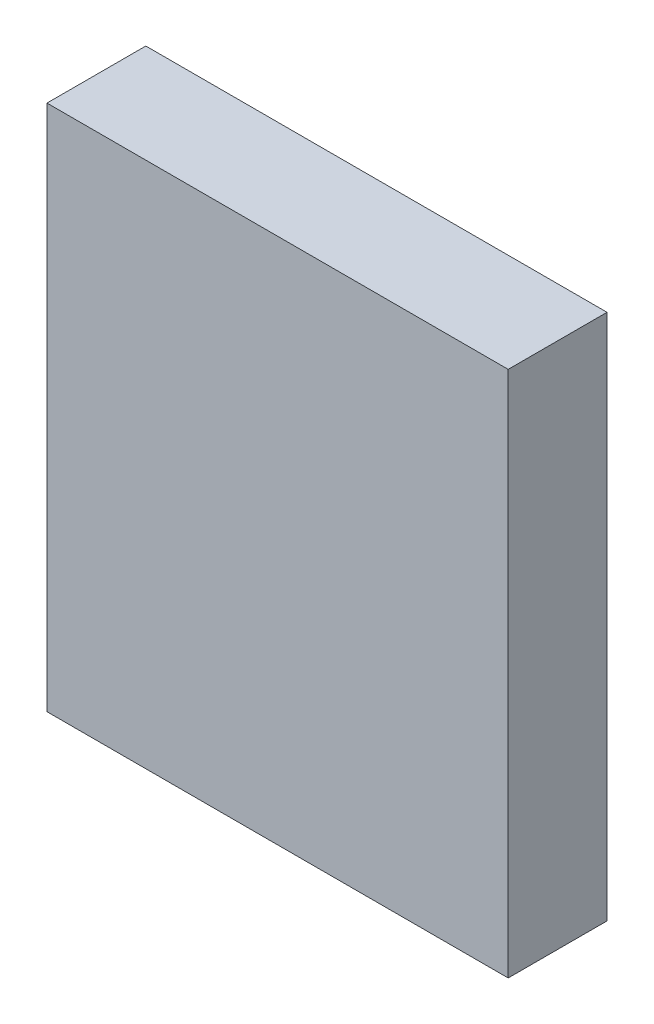
ISO-10303-21;
HEADER;
FILE_DESCRIPTION(('STEP AP214'),'2;1');
FILE_NAME('part.step','',(''),(''),'','','');
FILE_SCHEMA(('AUTOMOTIVE_DESIGN { 1 0 10303 214 1 1 1 1 }'));
ENDSEC;
DATA;
#1=APPLICATION_CONTEXT('core data for automotive mechanical design processes');
#2=APPLICATION_PROTOCOL_DEFINITION('international standard','automotive_design',2000,#1);
#3=PRODUCT_CONTEXT('',#1,'mechanical');
#4=PRODUCT('Part','Part','',(#3));
#5=PRODUCT_RELATED_PRODUCT_CATEGORY('part','',(#4));
#6=PRODUCT_DEFINITION_FORMATION('','',#4);
#7=PRODUCT_DEFINITION_CONTEXT('part definition',#1,'design');
#8=PRODUCT_DEFINITION('design','',#6,#7);
#9=PRODUCT_DEFINITION_SHAPE('','',#8);
#10=(LENGTH_UNIT() NAMED_UNIT(*) SI_UNIT(.MILLI.,.METRE.));
#11=(NAMED_UNIT(*) PLANE_ANGLE_UNIT() SI_UNIT($,.RADIAN.));
#12=(NAMED_UNIT(*) SI_UNIT($,.STERADIAN.) SOLID_ANGLE_UNIT());
#13=UNCERTAINTY_MEASURE_WITH_UNIT(LENGTH_MEASURE(1.E-05),#10,'distance_accuracy_value','');
#14=(GEOMETRIC_REPRESENTATION_CONTEXT(3) GLOBAL_UNCERTAINTY_ASSIGNED_CONTEXT((#13)) GLOBAL_UNIT_ASSIGNED_CONTEXT((#10,
#11,#12)) REPRESENTATION_CONTEXT('',''));
#15=CARTESIAN_POINT('',(0.,0.,0.));
#16=DIRECTION('',(0.,0.,1.));
#17=DIRECTION('',(1.,0.,0.));
#18=AXIS2_PLACEMENT_3D('',#15,#16,#17);
#19=CARTESIAN_POINT('',(0.,29.27740290761,76.2));
#20=DIRECTION('',(-1.,0.,0.));
#21=DIRECTION('',(0.,0.,1.));
#22=AXIS2_PLACEMENT_3D('',#19,#20,#21);
#23=PLANE('',#22);
#24=DIRECTION('',(0.,1.,0.));
#25=VECTOR('',#24,1.);
#26=CARTESIAN_POINT('',(0.,29.27740290761,0.));
#27=LINE('',#26,#25);
#28=CARTESIAN_POINT('',(0.,0.,0.));
#29=VERTEX_POINT('',#28);
#30=CARTESIAN_POINT('',(0.,406.4,0.));
#31=VERTEX_POINT('',#30);
#32=EDGE_CURVE('E101',#29,#31,#27,.T.);
#33=ORIENTED_EDGE('',*,*,#32,.F.);
#34=DIRECTION('',(0.,0.,-1.));
#35=VECTOR('',#34,1.);
#36=CARTESIAN_POINT('',(0.,0.,76.2));
#37=LINE('',#36,#35);
#38=CARTESIAN_POINT('',(0.,0.,76.2));
#39=VERTEX_POINT('',#38);
#40=EDGE_CURVE('E11',#39,#29,#37,.T.);
#41=ORIENTED_EDGE('',*,*,#40,.F.);
#42=DIRECTION('',(0.,1.,0.));
#43=VECTOR('',#42,1.);
#44=CARTESIAN_POINT('',(0.,29.27740290761,76.2));
#45=LINE('',#44,#43);
#46=CARTESIAN_POINT('',(0.,406.4,76.2));
#47=VERTEX_POINT('',#46);
#48=EDGE_CURVE('E79',#39,#47,#45,.T.);
#49=ORIENTED_EDGE('',*,*,#48,.T.);
#50=DIRECTION('',(0.,0.,-1.));
#51=VECTOR('',#50,1.);
#52=CARTESIAN_POINT('',(0.,406.4,76.2));
#53=LINE('',#52,#51);
#54=EDGE_CURVE('E38',#47,#31,#53,.T.);
#55=ORIENTED_EDGE('',*,*,#54,.T.);
#56=EDGE_LOOP('',(#33,#41,#49,#55));
#57=FACE_BOUND('',#56,.T.);
#58=ADVANCED_FACE('F16',(#57),#23,.T.);
#59=CARTESIAN_POINT('',(33.0767557024956,0.,76.2));
#60=DIRECTION('',(0.,1.,0.));
#61=DIRECTION('',(0.,0.,1.));
#62=AXIS2_PLACEMENT_3D('',#59,#60,#61);
#63=PLANE('',#62);
#64=DIRECTION('',(1.,0.,0.));
#65=VECTOR('',#64,1.);
#66=CARTESIAN_POINT('',(33.0767557024956,0.,0.));
#67=LINE('',#66,#65);
#68=CARTESIAN_POINT('',(355.6,0.,0.));
#69=VERTEX_POINT('',#68);
#70=EDGE_CURVE('E86',#29,#69,#67,.T.);
#71=ORIENTED_EDGE('',*,*,#70,.T.);
#72=DIRECTION('',(0.,0.,-1.));
#73=VECTOR('',#72,1.);
#74=CARTESIAN_POINT('',(355.6,0.,76.2));
#75=LINE('',#74,#73);
#76=CARTESIAN_POINT('',(355.6,0.,76.2));
#77=VERTEX_POINT('',#76);
#78=EDGE_CURVE('E25',#77,#69,#75,.T.);
#79=ORIENTED_EDGE('',*,*,#78,.F.);
#80=DIRECTION('',(1.,0.,0.));
#81=VECTOR('',#80,1.);
#82=CARTESIAN_POINT('',(33.0767557024956,0.,76.2));
#83=LINE('',#82,#81);
#84=EDGE_CURVE('E73',#39,#77,#83,.T.);
#85=ORIENTED_EDGE('',*,*,#84,.F.);
#86=ORIENTED_EDGE('',*,*,#40,.T.);
#87=EDGE_LOOP('',(#71,#79,#85,#86));
#88=FACE_BOUND('',#87,.T.);
#89=ADVANCED_FACE('F84',(#88),#63,.F.);
#90=CARTESIAN_POINT('',(355.6,29.27740290761,76.2));
#91=DIRECTION('',(-1.,0.,0.));
#92=DIRECTION('',(0.,-1.,0.));
#93=AXIS2_PLACEMENT_3D('',#90,#91,#92);
#94=PLANE('',#93);
#95=DIRECTION('',(0.,1.,0.));
#96=VECTOR('',#95,1.);
#97=CARTESIAN_POINT('',(355.6,29.27740290761,0.));
#98=LINE('',#97,#96);
#99=CARTESIAN_POINT('',(355.6,406.4,0.));
#100=VERTEX_POINT('',#99);
#101=EDGE_CURVE('E106',#69,#100,#98,.T.);
#102=ORIENTED_EDGE('',*,*,#101,.T.);
#103=DIRECTION('',(0.,0.,-1.));
#104=VECTOR('',#103,1.);
#105=CARTESIAN_POINT('',(355.6,406.4,76.2));
#106=LINE('',#105,#104);
#107=CARTESIAN_POINT('',(355.6,406.4,76.2));
#108=VERTEX_POINT('',#107);
#109=EDGE_CURVE('E56',#108,#100,#106,.T.);
#110=ORIENTED_EDGE('',*,*,#109,.F.);
#111=DIRECTION('',(0.,1.,0.));
#112=VECTOR('',#111,1.);
#113=CARTESIAN_POINT('',(355.6,29.27740290761,76.2));
#114=LINE('',#113,#112);
#115=EDGE_CURVE('E78',#77,#108,#114,.T.);
#116=ORIENTED_EDGE('',*,*,#115,.F.);
#117=ORIENTED_EDGE('',*,*,#78,.T.);
#118=EDGE_LOOP('',(#102,#110,#116,#117));
#119=FACE_BOUND('',#118,.T.);
#120=ADVANCED_FACE('F90',(#119),#94,.F.);
#121=CARTESIAN_POINT('',(33.0767557024955,406.4,76.2));
#122=DIRECTION('',(0.,1.,0.));
#123=DIRECTION('',(0.,0.,1.));
#124=AXIS2_PLACEMENT_3D('',#121,#122,#123);
#125=PLANE('',#124);
#126=DIRECTION('',(1.,0.,0.));
#127=VECTOR('',#126,1.);
#128=CARTESIAN_POINT('',(33.0767557024955,406.4,0.));
#129=LINE('',#128,#127);
#130=EDGE_CURVE('E108',#31,#100,#129,.T.);
#131=ORIENTED_EDGE('',*,*,#130,.F.);
#132=ORIENTED_EDGE('',*,*,#54,.F.);
#133=DIRECTION('',(1.,0.,0.));
#134=VECTOR('',#133,1.);
#135=CARTESIAN_POINT('',(33.0767557024955,406.4,76.2));
#136=LINE('',#135,#134);
#137=EDGE_CURVE('E92',#47,#108,#136,.T.);
#138=ORIENTED_EDGE('',*,*,#137,.T.);
#139=ORIENTED_EDGE('',*,*,#109,.T.);
#140=EDGE_LOOP('',(#131,#132,#138,#139));
#141=FACE_BOUND('',#140,.T.);
#142=ADVANCED_FACE('F127',(#141),#125,.T.);
#143=CARTESIAN_POINT('',(177.8,203.2,76.2));
#144=DIRECTION('',(0.,0.,1.));
#145=DIRECTION('',(1.,0.,0.));
#146=AXIS2_PLACEMENT_3D('',#143,#144,#145);
#147=PLANE('',#146);
#148=ORIENTED_EDGE('',*,*,#48,.F.);
#149=ORIENTED_EDGE('',*,*,#84,.T.);
#150=ORIENTED_EDGE('',*,*,#115,.T.);
#151=ORIENTED_EDGE('',*,*,#137,.F.);
#152=EDGE_LOOP('',(#148,#149,#150,#151));
#153=FACE_BOUND('',#152,.T.);
#154=ADVANCED_FACE('F75',(#153),#147,.T.);
#155=CARTESIAN_POINT('',(177.8,203.2,0.));
#156=DIRECTION('',(0.,0.,1.));
#157=DIRECTION('',(1.,0.,0.));
#158=AXIS2_PLACEMENT_3D('',#155,#156,#157);
#159=PLANE('',#158);
#160=ORIENTED_EDGE('',*,*,#32,.T.);
#161=ORIENTED_EDGE('',*,*,#130,.T.);
#162=ORIENTED_EDGE('',*,*,#101,.F.);
#163=ORIENTED_EDGE('',*,*,#70,.F.);
#164=EDGE_LOOP('',(#160,#161,#162,#163));
#165=FACE_BOUND('',#164,.T.);
#166=ADVANCED_FACE('F135',(#165),#159,.F.);
#167=CLOSED_SHELL('',(#58,#89,#120,#142,#154,#166));
#168=MANIFOLD_SOLID_BREP('B1',#167);
#169=ADVANCED_BREP_SHAPE_REPRESENTATION('',(#18,#168),#14);
#170=SHAPE_DEFINITION_REPRESENTATION(#9,#169);
ENDSEC;
END-ISO-10303-21;
